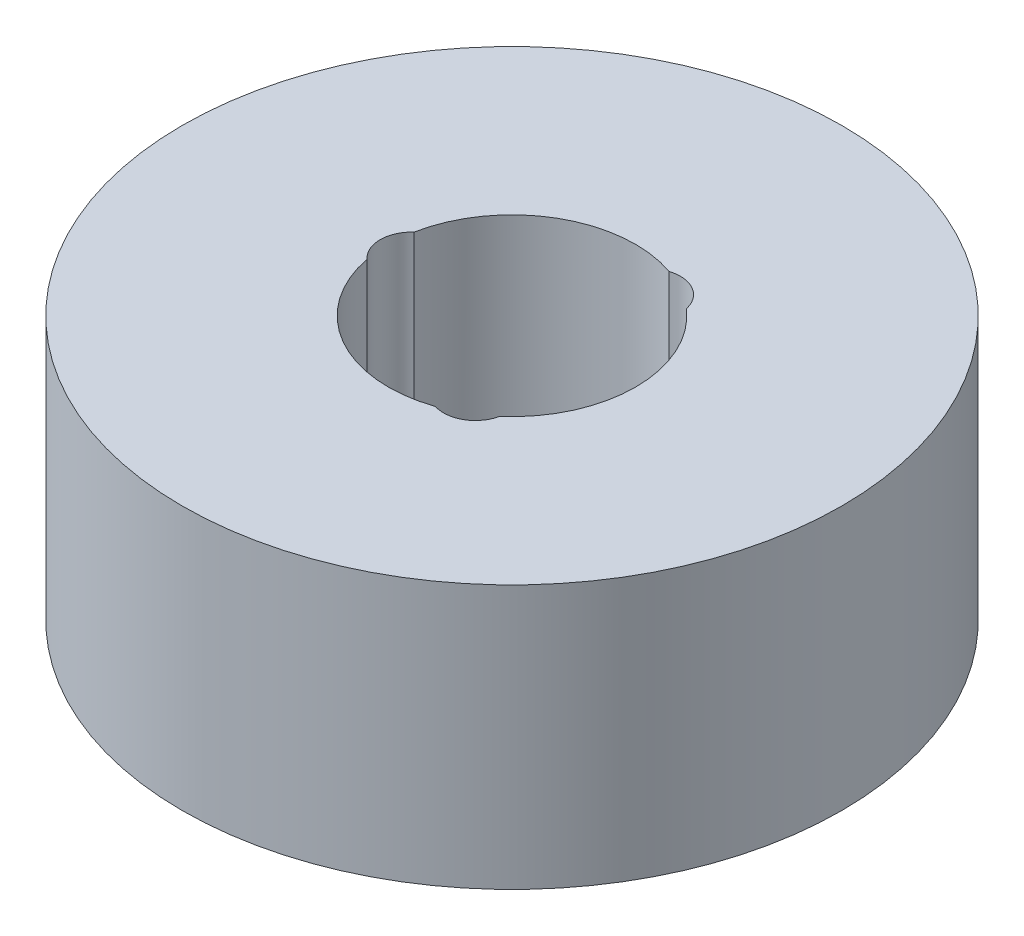
ISO-10303-21;
HEADER;
FILE_DESCRIPTION(('STEP AP214'),'2;1');
FILE_NAME('part.step','',(''),(''),'','','');
FILE_SCHEMA(('AUTOMOTIVE_DESIGN { 1 0 10303 214 1 1 1 1 }'));
ENDSEC;
DATA;
#1=APPLICATION_CONTEXT('core data for automotive mechanical design processes');
#2=APPLICATION_PROTOCOL_DEFINITION('international standard','automotive_design',2000,#1);
#3=PRODUCT_CONTEXT('',#1,'mechanical');
#4=PRODUCT('Part','Part','',(#3));
#5=PRODUCT_RELATED_PRODUCT_CATEGORY('part','',(#4));
#6=PRODUCT_DEFINITION_FORMATION('','',#4);
#7=PRODUCT_DEFINITION_CONTEXT('part definition',#1,'design');
#8=PRODUCT_DEFINITION('design','',#6,#7);
#9=PRODUCT_DEFINITION_SHAPE('','',#8);
#10=(LENGTH_UNIT() NAMED_UNIT(*) SI_UNIT(.MILLI.,.METRE.));
#11=(NAMED_UNIT(*) PLANE_ANGLE_UNIT() SI_UNIT($,.RADIAN.));
#12=(NAMED_UNIT(*) SI_UNIT($,.STERADIAN.) SOLID_ANGLE_UNIT());
#13=UNCERTAINTY_MEASURE_WITH_UNIT(LENGTH_MEASURE(1.E-05),#10,'distance_accuracy_value','');
#14=(GEOMETRIC_REPRESENTATION_CONTEXT(3) GLOBAL_UNCERTAINTY_ASSIGNED_CONTEXT((#13)) GLOBAL_UNIT_ASSIGNED_CONTEXT((#10,
#11,#12)) REPRESENTATION_CONTEXT('',''));
#15=CARTESIAN_POINT('',(0.,0.,0.));
#16=DIRECTION('',(0.,0.,1.));
#17=DIRECTION('',(1.,0.,0.));
#18=AXIS2_PLACEMENT_3D('',#15,#16,#17);
#19=CARTESIAN_POINT('',(0.,16.,0.));
#20=DIRECTION('',(0.,-1.,0.));
#21=DIRECTION('',(0.,0.,-1.));
#22=AXIS2_PLACEMENT_3D('',#19,#20,#21);
#23=CYLINDRICAL_SURFACE('',#22,20.);
#24=CARTESIAN_POINT('',(0.,16.,0.));
#25=DIRECTION('',(0.,1.,0.));
#26=DIRECTION('',(0.,0.,1.));
#27=AXIS2_PLACEMENT_3D('',#24,#25,#26);
#28=CIRCLE('',#27,20.);
#29=CARTESIAN_POINT('',(0.,16.,20.));
#30=VERTEX_POINT('',#29);
#31=EDGE_CURVE('E130',#30,#30,#28,.T.);
#32=ORIENTED_EDGE('',*,*,#31,.F.);
#33=EDGE_LOOP('',(#32));
#34=FACE_BOUND('',#33,.T.);
#35=CARTESIAN_POINT('',(0.,0.,0.));
#36=DIRECTION('',(0.,1.,0.));
#37=DIRECTION('',(0.,0.,1.));
#38=AXIS2_PLACEMENT_3D('',#35,#36,#37);
#39=CIRCLE('',#38,20.);
#40=CARTESIAN_POINT('',(0.,0.,20.));
#41=VERTEX_POINT('',#40);
#42=EDGE_CURVE('E117',#41,#41,#39,.T.);
#43=ORIENTED_EDGE('',*,*,#42,.T.);
#44=EDGE_LOOP('',(#43));
#45=FACE_BOUND('',#44,.T.);
#46=ADVANCED_FACE('F39',(#34,#45),#23,.T.);
#47=CARTESIAN_POINT('',(0.,16.,0.));
#48=DIRECTION('',(0.,1.,0.));
#49=DIRECTION('',(0.,0.,1.));
#50=AXIS2_PLACEMENT_3D('',#47,#48,#49);
#51=PLANE('',#50);
#52=CARTESIAN_POINT('',(3.03367002692604,16.,5.25447062003469));
#53=DIRECTION('',(0.,1.,0.));
#54=DIRECTION('',(0.866025403784436,0.,-0.500000000000004));
#55=AXIS2_PLACEMENT_3D('',#52,#53,#54);
#56=CIRCLE('',#55,1.92823153278477);
#57=CARTESIAN_POINT('',(2.4444381622213,16.,7.09046698540203));
#58=VERTEX_POINT('',#57);
#59=CARTESIAN_POINT('',(4.91830545294242,16.,5.66217903916476));
#60=VERTEX_POINT('',#59);
#61=EDGE_CURVE('E148',#58,#60,#56,.T.);
#62=ORIENTED_EDGE('',*,*,#61,.F.);
#63=CARTESIAN_POINT('',(0.,16.,0.));
#64=DIRECTION('',(0.,1.,0.));
#65=DIRECTION('',(0.,0.,1.));
#66=AXIS2_PLACEMENT_3D('',#63,#64,#65);
#67=CIRCLE('',#66,7.5);
#68=CARTESIAN_POINT('',(-7.36274361516367,16.,1.42828794623725));
#69=VERTEX_POINT('',#68);
#70=EDGE_CURVE('E113',#69,#58,#67,.T.);
#71=ORIENTED_EDGE('',*,*,#70,.F.);
#72=CARTESIAN_POINT('',(-6.06734005385203,16.,0.));
#73=DIRECTION('',(0.,1.,0.));
#74=DIRECTION('',(0.,0.,1.));
#75=AXIS2_PLACEMENT_3D('',#72,#73,#74);
#76=CIRCLE('',#75,1.92823153278477);
#77=CARTESIAN_POINT('',(-7.36274361516367,16.,-1.42828794623725));
#78=VERTEX_POINT('',#77);
#79=EDGE_CURVE('E125',#78,#69,#76,.T.);
#80=ORIENTED_EDGE('',*,*,#79,.F.);
#81=CARTESIAN_POINT('',(2.4444381622212,16.,-7.09046698540206));
#82=VERTEX_POINT('',#81);
#83=EDGE_CURVE('E107',#82,#78,#67,.T.);
#84=ORIENTED_EDGE('',*,*,#83,.F.);
#85=CARTESIAN_POINT('',(3.03367002692597,16.,-5.25447062003473));
#86=DIRECTION('',(0.,1.,0.));
#87=DIRECTION('',(-0.866025403784443,0.,-0.499999999999992));
#88=AXIS2_PLACEMENT_3D('',#85,#86,#87);
#89=CIRCLE('',#88,1.92823153278477);
#90=CARTESIAN_POINT('',(4.91830545294234,16.,-5.66217903916483));
#91=VERTEX_POINT('',#90);
#92=EDGE_CURVE('E95',#91,#82,#89,.T.);
#93=ORIENTED_EDGE('',*,*,#92,.F.);
#94=EDGE_CURVE('E106',#60,#91,#67,.T.);
#95=ORIENTED_EDGE('',*,*,#94,.F.);
#96=EDGE_LOOP('',(#62,#71,#80,#84,#93,#95));
#97=FACE_BOUND('',#96,.T.);
#98=ORIENTED_EDGE('',*,*,#31,.T.);
#99=EDGE_LOOP('',(#98));
#100=FACE_BOUND('',#99,.T.);
#101=ADVANCED_FACE('F102',(#97,#100),#51,.T.);
#102=CARTESIAN_POINT('',(0.,0.,0.));
#103=DIRECTION('',(0.,1.,0.));
#104=DIRECTION('',(0.,0.,1.));
#105=AXIS2_PLACEMENT_3D('',#102,#103,#104);
#106=PLANE('',#105);
#107=CARTESIAN_POINT('',(0.,0.,0.));
#108=DIRECTION('',(0.,1.,0.));
#109=DIRECTION('',(0.,0.,1.));
#110=AXIS2_PLACEMENT_3D('',#107,#108,#109);
#111=CIRCLE('',#110,7.5);
#112=CARTESIAN_POINT('',(0.,0.,7.5));
#113=VERTEX_POINT('',#112);
#114=EDGE_CURVE('E118',#113,#113,#111,.T.);
#115=ORIENTED_EDGE('',*,*,#114,.T.);
#116=EDGE_LOOP('',(#115));
#117=FACE_BOUND('',#116,.T.);
#118=ORIENTED_EDGE('',*,*,#42,.F.);
#119=EDGE_LOOP('',(#118));
#120=FACE_BOUND('',#119,.T.);
#121=ADVANCED_FACE('F161',(#117,#120),#106,.F.);
#122=CARTESIAN_POINT('',(0.,16.,0.));
#123=DIRECTION('',(0.,-1.,0.));
#124=DIRECTION('',(0.,0.,-1.));
#125=AXIS2_PLACEMENT_3D('',#122,#123,#124);
#126=CYLINDRICAL_SURFACE('',#125,7.5);
#127=DIRECTION('',(0.,1.,0.));
#128=VECTOR('',#127,1.);
#129=CARTESIAN_POINT('',(2.4444381622213,11.0928091574595,7.09046698540203));
#130=LINE('',#129,#128);
#131=CARTESIAN_POINT('',(2.4444381622213,6.18561831491906,7.09046698540203));
#132=VERTEX_POINT('',#131);
#133=EDGE_CURVE('E11',#132,#58,#130,.T.);
#134=ORIENTED_EDGE('',*,*,#133,.F.);
#135=CARTESIAN_POINT('',(0.,6.18561831491906,0.));
#136=DIRECTION('',(0.,1.,0.));
#137=DIRECTION('',(0.,0.,1.));
#138=AXIS2_PLACEMENT_3D('',#135,#136,#137);
#139=CIRCLE('',#138,7.5);
#140=CARTESIAN_POINT('',(4.91830545294242,6.18561831491906,5.66217903916476));
#141=VERTEX_POINT('',#140);
#142=EDGE_CURVE('E100',#132,#141,#139,.T.);
#143=ORIENTED_EDGE('',*,*,#142,.T.);
#144=DIRECTION('',(0.,1.,0.));
#145=VECTOR('',#144,1.);
#146=CARTESIAN_POINT('',(4.91830545294242,11.0928091574595,5.66217903916476));
#147=LINE('',#146,#145);
#148=EDGE_CURVE('E46',#60,#141,#147,.F.);
#149=ORIENTED_EDGE('',*,*,#148,.F.);
#150=ORIENTED_EDGE('',*,*,#94,.T.);
#151=DIRECTION('',(0.,1.,0.));
#152=VECTOR('',#151,1.);
#153=CARTESIAN_POINT('',(4.91830545294234,11.0928091574595,-5.66217903916483));
#154=LINE('',#153,#152);
#155=CARTESIAN_POINT('',(4.91830545294234,6.18561831491906,-5.66217903916483));
#156=VERTEX_POINT('',#155);
#157=EDGE_CURVE('E90',#156,#91,#154,.T.);
#158=ORIENTED_EDGE('',*,*,#157,.F.);
#159=CARTESIAN_POINT('',(0.,6.18561831491906,0.));
#160=DIRECTION('',(0.,1.,0.));
#161=DIRECTION('',(0.,0.,1.));
#162=AXIS2_PLACEMENT_3D('',#159,#160,#161);
#163=CIRCLE('',#162,7.5);
#164=CARTESIAN_POINT('',(2.4444381622212,6.18561831491906,-7.09046698540206));
#165=VERTEX_POINT('',#164);
#166=EDGE_CURVE('E143',#156,#165,#163,.T.);
#167=ORIENTED_EDGE('',*,*,#166,.T.);
#168=DIRECTION('',(0.,1.,0.));
#169=VECTOR('',#168,1.);
#170=CARTESIAN_POINT('',(2.4444381622212,11.0928091574595,-7.09046698540206));
#171=LINE('',#170,#169);
#172=EDGE_CURVE('E98',#82,#165,#171,.F.);
#173=ORIENTED_EDGE('',*,*,#172,.F.);
#174=ORIENTED_EDGE('',*,*,#83,.T.);
#175=DIRECTION('',(0.,1.,0.));
#176=VECTOR('',#175,1.);
#177=CARTESIAN_POINT('',(-7.36274361516367,11.0928091574595,-1.42828794623725));
#178=LINE('',#177,#176);
#179=CARTESIAN_POINT('',(-7.36274361516367,6.18561831491906,-1.42828794623725));
#180=VERTEX_POINT('',#179);
#181=EDGE_CURVE('E137',#180,#78,#178,.T.);
#182=ORIENTED_EDGE('',*,*,#181,.F.);
#183=CARTESIAN_POINT('',(0.,6.18561831491906,0.));
#184=DIRECTION('',(0.,1.,0.));
#185=DIRECTION('',(0.,0.,1.));
#186=AXIS2_PLACEMENT_3D('',#183,#184,#185);
#187=CIRCLE('',#186,7.5);
#188=CARTESIAN_POINT('',(-7.36274361516367,6.18561831491906,1.42828794623725));
#189=VERTEX_POINT('',#188);
#190=EDGE_CURVE('E128',#180,#189,#187,.T.);
#191=ORIENTED_EDGE('',*,*,#190,.T.);
#192=DIRECTION('',(0.,1.,0.));
#193=VECTOR('',#192,1.);
#194=CARTESIAN_POINT('',(-7.36274361516367,11.0928091574595,1.42828794623725));
#195=LINE('',#194,#193);
#196=EDGE_CURVE('E134',#69,#189,#195,.F.);
#197=ORIENTED_EDGE('',*,*,#196,.F.);
#198=ORIENTED_EDGE('',*,*,#70,.T.);
#199=EDGE_LOOP('',(#134,#143,#149,#150,#158,#167,#173,#174,#182,#191,#197,#198));
#200=FACE_BOUND('',#199,.T.);
#201=ORIENTED_EDGE('',*,*,#114,.F.);
#202=EDGE_LOOP('',(#201));
#203=FACE_BOUND('',#202,.T.);
#204=ADVANCED_FACE('F115',(#200,#203),#126,.F.);
#205=CARTESIAN_POINT('',(-6.06734005385203,6.18561831491906,0.));
#206=DIRECTION('',(0.,1.,0.));
#207=DIRECTION('',(0.,0.,1.));
#208=AXIS2_PLACEMENT_3D('',#205,#206,#207);
#209=CYLINDRICAL_SURFACE('',#208,1.92823153278477);
#210=ORIENTED_EDGE('',*,*,#181,.T.);
#211=ORIENTED_EDGE('',*,*,#79,.T.);
#212=ORIENTED_EDGE('',*,*,#196,.T.);
#213=CARTESIAN_POINT('',(-6.06734005385203,6.18561831491906,0.));
#214=DIRECTION('',(0.,1.,0.));
#215=DIRECTION('',(0.,0.,1.));
#216=AXIS2_PLACEMENT_3D('',#213,#214,#215);
#217=CIRCLE('',#216,1.92823153278477);
#218=EDGE_CURVE('E127',#180,#189,#217,.T.);
#219=ORIENTED_EDGE('',*,*,#218,.F.);
#220=EDGE_LOOP('',(#210,#211,#212,#219));
#221=FACE_BOUND('',#220,.T.);
#222=ADVANCED_FACE('F175',(#221),#209,.F.);
#223=CARTESIAN_POINT('',(-6.06734005385203,6.18561831491906,0.));
#224=DIRECTION('',(0.,1.,0.));
#225=DIRECTION('',(0.,0.,1.));
#226=AXIS2_PLACEMENT_3D('',#223,#224,#225);
#227=PLANE('',#226);
#228=ORIENTED_EDGE('',*,*,#218,.T.);
#229=ORIENTED_EDGE('',*,*,#190,.F.);
#230=EDGE_LOOP('',(#228,#229));
#231=FACE_BOUND('',#230,.T.);
#232=ADVANCED_FACE('F176',(#231),#227,.T.);
#233=CARTESIAN_POINT('',(3.03367002692597,6.18561831491906,-5.25447062003473));
#234=DIRECTION('',(0.,1.,0.));
#235=DIRECTION('',(0.,0.,1.));
#236=AXIS2_PLACEMENT_3D('',#233,#234,#235);
#237=CYLINDRICAL_SURFACE('',#236,1.92823153278477);
#238=ORIENTED_EDGE('',*,*,#157,.T.);
#239=ORIENTED_EDGE('',*,*,#92,.T.);
#240=ORIENTED_EDGE('',*,*,#172,.T.);
#241=CARTESIAN_POINT('',(3.03367002692597,6.18561831491906,-5.25447062003473));
#242=DIRECTION('',(0.,1.,0.));
#243=DIRECTION('',(-0.866025403784443,0.,-0.499999999999992));
#244=AXIS2_PLACEMENT_3D('',#241,#242,#243);
#245=CIRCLE('',#244,1.92823153278477);
#246=EDGE_CURVE('E56',#156,#165,#245,.T.);
#247=ORIENTED_EDGE('',*,*,#246,.F.);
#248=EDGE_LOOP('',(#238,#239,#240,#247));
#249=FACE_BOUND('',#248,.T.);
#250=ADVANCED_FACE('F93',(#249),#237,.F.);
#251=CARTESIAN_POINT('',(3.03367002692597,6.18561831491906,-5.25447062003473));
#252=DIRECTION('',(0.,1.,0.));
#253=DIRECTION('',(-0.866025403784443,0.,-0.499999999999992));
#254=AXIS2_PLACEMENT_3D('',#251,#252,#253);
#255=PLANE('',#254);
#256=ORIENTED_EDGE('',*,*,#246,.T.);
#257=ORIENTED_EDGE('',*,*,#166,.F.);
#258=EDGE_LOOP('',(#256,#257));
#259=FACE_BOUND('',#258,.T.);
#260=ADVANCED_FACE('F153',(#259),#255,.T.);
#261=CARTESIAN_POINT('',(3.03367002692604,6.18561831491906,5.25447062003469));
#262=DIRECTION('',(0.,1.,0.));
#263=DIRECTION('',(0.,0.,1.));
#264=AXIS2_PLACEMENT_3D('',#261,#262,#263);
#265=CYLINDRICAL_SURFACE('',#264,1.92823153278477);
#266=ORIENTED_EDGE('',*,*,#133,.T.);
#267=ORIENTED_EDGE('',*,*,#61,.T.);
#268=ORIENTED_EDGE('',*,*,#148,.T.);
#269=CARTESIAN_POINT('',(3.03367002692604,6.18561831491906,5.25447062003469));
#270=DIRECTION('',(0.,1.,0.));
#271=DIRECTION('',(0.866025403784436,0.,-0.500000000000004));
#272=AXIS2_PLACEMENT_3D('',#269,#270,#271);
#273=CIRCLE('',#272,1.92823153278477);
#274=EDGE_CURVE('E55',#132,#141,#273,.T.);
#275=ORIENTED_EDGE('',*,*,#274,.F.);
#276=EDGE_LOOP('',(#266,#267,#268,#275));
#277=FACE_BOUND('',#276,.T.);
#278=ADVANCED_FACE('F144',(#277),#265,.F.);
#279=CARTESIAN_POINT('',(3.03367002692604,6.18561831491906,5.25447062003469));
#280=DIRECTION('',(0.,1.,0.));
#281=DIRECTION('',(0.866025403784436,0.,-0.500000000000004));
#282=AXIS2_PLACEMENT_3D('',#279,#280,#281);
#283=PLANE('',#282);
#284=ORIENTED_EDGE('',*,*,#274,.T.);
#285=ORIENTED_EDGE('',*,*,#142,.F.);
#286=EDGE_LOOP('',(#284,#285));
#287=FACE_BOUND('',#286,.T.);
#288=ADVANCED_FACE('F150',(#287),#283,.T.);
#289=CLOSED_SHELL('',(#46,#101,#121,#204,#222,#232,#250,#260,#278,#288));
#290=MANIFOLD_SOLID_BREP('B2',#289);
#291=ADVANCED_BREP_SHAPE_REPRESENTATION('',(#18,#290),#14);
#292=SHAPE_DEFINITION_REPRESENTATION(#9,#291);
ENDSEC;
END-ISO-10303-21;
